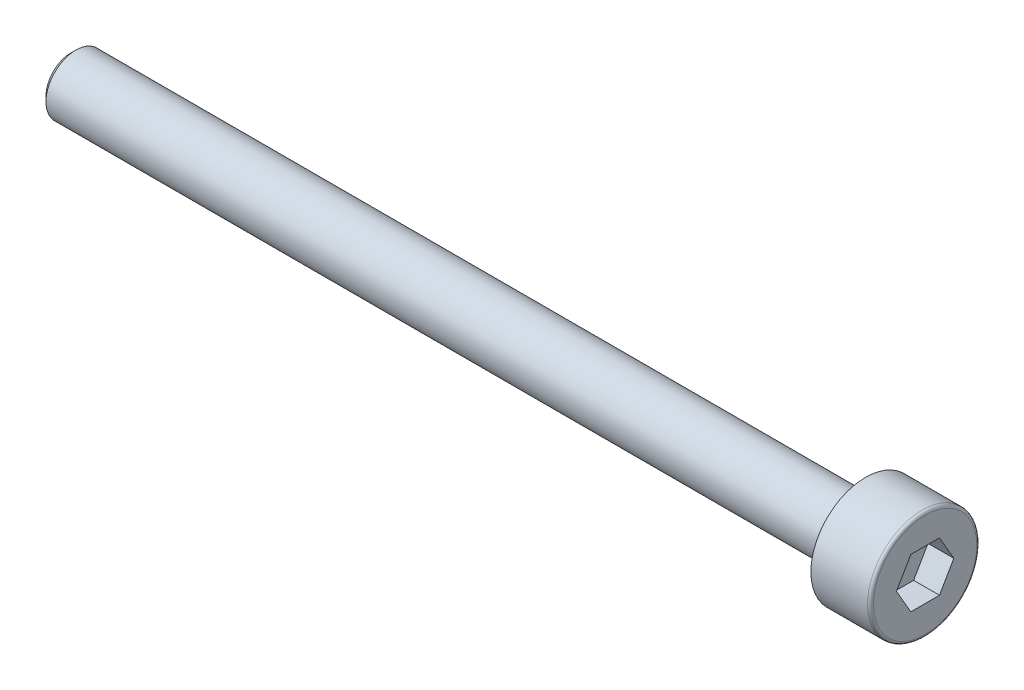
ISO-10303-21;
HEADER;
FILE_DESCRIPTION(('STEP AP214'),'2;1');
FILE_NAME('part.step','',(''),(''),'','','');
FILE_SCHEMA(('AUTOMOTIVE_DESIGN { 1 0 10303 214 1 1 1 1 }'));
ENDSEC;
DATA;
#1=APPLICATION_CONTEXT('core data for automotive mechanical design processes');
#2=APPLICATION_PROTOCOL_DEFINITION('international standard','automotive_design',2000,#1);
#3=PRODUCT_CONTEXT('',#1,'mechanical');
#4=PRODUCT('Part','Part','',(#3));
#5=PRODUCT_RELATED_PRODUCT_CATEGORY('part','',(#4));
#6=PRODUCT_DEFINITION_FORMATION('','',#4);
#7=PRODUCT_DEFINITION_CONTEXT('part definition',#1,'design');
#8=PRODUCT_DEFINITION('design','',#6,#7);
#9=PRODUCT_DEFINITION_SHAPE('','',#8);
#10=(LENGTH_UNIT() NAMED_UNIT(*) SI_UNIT(.MILLI.,.METRE.));
#11=(NAMED_UNIT(*) PLANE_ANGLE_UNIT() SI_UNIT($,.RADIAN.));
#12=(NAMED_UNIT(*) SI_UNIT($,.STERADIAN.) SOLID_ANGLE_UNIT());
#13=UNCERTAINTY_MEASURE_WITH_UNIT(LENGTH_MEASURE(1.E-05),#10,'distance_accuracy_value','');
#14=(GEOMETRIC_REPRESENTATION_CONTEXT(3) GLOBAL_UNCERTAINTY_ASSIGNED_CONTEXT((#13)) GLOBAL_UNIT_ASSIGNED_CONTEXT((#10,
#11,#12)) REPRESENTATION_CONTEXT('',''));
#15=CARTESIAN_POINT('',(0.,0.,0.));
#16=DIRECTION('',(0.,0.,1.));
#17=DIRECTION('',(1.,0.,0.));
#18=AXIS2_PLACEMENT_3D('',#15,#16,#17);
#19=CARTESIAN_POINT('',(0.,0.,0.));
#20=DIRECTION('',(1.,0.,0.));
#21=DIRECTION('',(0.,1.,0.));
#22=AXIS2_PLACEMENT_3D('',#19,#20,#21);
#23=PLANE('',#22);
#24=DIRECTION('',(0.,-0.866025403784439,0.5));
#25=VECTOR('',#24,1.);
#26=CARTESIAN_POINT('',(0.,1.25,0.721687836487035));
#27=LINE('',#26,#25);
#28=CARTESIAN_POINT('',(0.,1.25,0.721687836487035));
#29=VERTEX_POINT('',#28);
#30=CARTESIAN_POINT('',(0.,0.,1.44337567297407));
#31=VERTEX_POINT('',#30);
#32=EDGE_CURVE('E30',#29,#31,#27,.T.);
#33=ORIENTED_EDGE('',*,*,#32,.F.);
#34=DIRECTION('',(0.,0.,1.));
#35=VECTOR('',#34,1.);
#36=CARTESIAN_POINT('',(0.,1.25,-0.721687836487035));
#37=LINE('',#36,#35);
#38=CARTESIAN_POINT('',(0.,1.25,-0.721687836487035));
#39=VERTEX_POINT('',#38);
#40=EDGE_CURVE('E113',#39,#29,#37,.T.);
#41=ORIENTED_EDGE('',*,*,#40,.F.);
#42=DIRECTION('',(0.,0.866025403784439,0.5));
#43=VECTOR('',#42,1.);
#44=CARTESIAN_POINT('',(0.,0.,-1.44337567297406));
#45=LINE('',#44,#43);
#46=CARTESIAN_POINT('',(0.,0.,-1.44337567297406));
#47=VERTEX_POINT('',#46);
#48=EDGE_CURVE('E111',#47,#39,#45,.T.);
#49=ORIENTED_EDGE('',*,*,#48,.F.);
#50=DIRECTION('',(0.,0.866025403784439,-0.5));
#51=VECTOR('',#50,1.);
#52=CARTESIAN_POINT('',(0.,-1.25,-0.721687836487029));
#53=LINE('',#52,#51);
#54=CARTESIAN_POINT('',(0.,-1.25,-0.721687836487029));
#55=VERTEX_POINT('',#54);
#56=EDGE_CURVE('E78',#55,#47,#53,.T.);
#57=ORIENTED_EDGE('',*,*,#56,.F.);
#58=DIRECTION('',(0.,0.,-1.));
#59=VECTOR('',#58,1.);
#60=CARTESIAN_POINT('',(0.,-1.25,0.721687836487035));
#61=LINE('',#60,#59);
#62=CARTESIAN_POINT('',(0.,-1.25,0.721687836487035));
#63=VERTEX_POINT('',#62);
#64=EDGE_CURVE('E107',#63,#55,#61,.T.);
#65=ORIENTED_EDGE('',*,*,#64,.F.);
#66=DIRECTION('',(0.,-0.866025403784439,-0.5));
#67=VECTOR('',#66,1.);
#68=CARTESIAN_POINT('',(0.,0.,1.44337567297407));
#69=LINE('',#68,#67);
#70=EDGE_CURVE('E104',#31,#63,#69,.T.);
#71=ORIENTED_EDGE('',*,*,#70,.F.);
#72=EDGE_LOOP('',(#33,#41,#49,#57,#65,#71));
#73=FACE_BOUND('',#72,.T.);
#74=CARTESIAN_POINT('',(0.,0.,0.));
#75=DIRECTION('',(1.,0.,0.));
#76=DIRECTION('',(0.,1.,0.));
#77=AXIS2_PLACEMENT_3D('',#74,#75,#76);
#78=CIRCLE('',#77,2.6);
#79=CARTESIAN_POINT('',(0.,2.6,0.));
#80=VERTEX_POINT('',#79);
#81=EDGE_CURVE('E131',#80,#80,#78,.T.);
#82=ORIENTED_EDGE('',*,*,#81,.T.);
#83=EDGE_LOOP('',(#82));
#84=FACE_BOUND('',#83,.T.);
#85=ADVANCED_FACE('F15',(#73,#84),#23,.T.);
#86=CARTESIAN_POINT('',(-0.15,0.,0.));
#87=DIRECTION('',(1.,0.,0.));
#88=DIRECTION('',(0.,1.,0.));
#89=AXIS2_PLACEMENT_3D('',#86,#87,#88);
#90=TOROIDAL_SURFACE('',#89,2.6,0.15);
#91=CARTESIAN_POINT('',(-0.15,0.,0.));
#92=DIRECTION('',(1.,0.,0.));
#93=DIRECTION('',(0.,1.,0.));
#94=AXIS2_PLACEMENT_3D('',#91,#92,#93);
#95=CIRCLE('',#94,2.75);
#96=CARTESIAN_POINT('',(-0.15,2.75,0.));
#97=VERTEX_POINT('',#96);
#98=EDGE_CURVE('E128',#97,#97,#95,.T.);
#99=ORIENTED_EDGE('',*,*,#98,.T.);
#100=EDGE_LOOP('',(#99));
#101=FACE_BOUND('',#100,.T.);
#102=ORIENTED_EDGE('',*,*,#81,.F.);
#103=EDGE_LOOP('',(#102));
#104=FACE_BOUND('',#103,.T.);
#105=ADVANCED_FACE('F150',(#101,#104),#90,.T.);
#106=CARTESIAN_POINT('',(0.,0.,0.));
#107=DIRECTION('',(1.,0.,0.));
#108=DIRECTION('',(0.,1.,0.));
#109=AXIS2_PLACEMENT_3D('',#106,#107,#108);
#110=CYLINDRICAL_SURFACE('',#109,2.75);
#111=CARTESIAN_POINT('',(-3.,0.,0.));
#112=DIRECTION('',(1.,0.,0.));
#113=DIRECTION('',(0.,1.,0.));
#114=AXIS2_PLACEMENT_3D('',#111,#112,#113);
#115=CIRCLE('',#114,2.75);
#116=CARTESIAN_POINT('',(-3.,2.75,0.));
#117=VERTEX_POINT('',#116);
#118=EDGE_CURVE('E125',#117,#117,#115,.T.);
#119=ORIENTED_EDGE('',*,*,#118,.T.);
#120=EDGE_LOOP('',(#119));
#121=FACE_BOUND('',#120,.T.);
#122=ORIENTED_EDGE('',*,*,#98,.F.);
#123=EDGE_LOOP('',(#122));
#124=FACE_BOUND('',#123,.T.);
#125=ADVANCED_FACE('F156',(#121,#124),#110,.T.);
#126=CARTESIAN_POINT('',(-3.,2.75,0.));
#127=DIRECTION('',(-1.,0.,0.));
#128=DIRECTION('',(0.,-1.,0.));
#129=AXIS2_PLACEMENT_3D('',#126,#127,#128);
#130=PLANE('',#129);
#131=CARTESIAN_POINT('',(-3.,0.,0.));
#132=DIRECTION('',(1.,0.,0.));
#133=DIRECTION('',(0.,1.,0.));
#134=AXIS2_PLACEMENT_3D('',#131,#132,#133);
#135=CIRCLE('',#134,1.5);
#136=CARTESIAN_POINT('',(-3.,1.5,0.));
#137=VERTEX_POINT('',#136);
#138=EDGE_CURVE('E117',#137,#137,#135,.T.);
#139=ORIENTED_EDGE('',*,*,#138,.T.);
#140=EDGE_LOOP('',(#139));
#141=FACE_BOUND('',#140,.T.);
#142=ORIENTED_EDGE('',*,*,#118,.F.);
#143=EDGE_LOOP('',(#142));
#144=FACE_BOUND('',#143,.T.);
#145=ADVANCED_FACE('F163',(#141,#144),#130,.T.);
#146=CARTESIAN_POINT('',(0.,0.,0.));
#147=DIRECTION('',(1.,0.,0.));
#148=DIRECTION('',(0.,1.,0.));
#149=AXIS2_PLACEMENT_3D('',#146,#147,#148);
#150=CYLINDRICAL_SURFACE('',#149,1.5);
#151=CARTESIAN_POINT('',(-42.75,0.,0.));
#152=DIRECTION('',(-1.,0.,0.));
#153=DIRECTION('',(0.,-1.,0.));
#154=AXIS2_PLACEMENT_3D('',#151,#152,#153);
#155=CIRCLE('',#154,1.5);
#156=CARTESIAN_POINT('',(-42.75,-1.50000000000001,0.));
#157=VERTEX_POINT('',#156);
#158=EDGE_CURVE('E23',#157,#157,#155,.F.);
#159=ORIENTED_EDGE('',*,*,#158,.T.);
#160=EDGE_LOOP('',(#159));
#161=FACE_BOUND('',#160,.T.);
#162=ORIENTED_EDGE('',*,*,#138,.F.);
#163=EDGE_LOOP('',(#162));
#164=FACE_BOUND('',#163,.T.);
#165=ADVANCED_FACE('F136',(#161,#164),#150,.T.);
#166=CARTESIAN_POINT('',(-43.,1.5,0.));
#167=DIRECTION('',(-1.,0.,0.));
#168=DIRECTION('',(0.,-1.,0.));
#169=AXIS2_PLACEMENT_3D('',#166,#167,#168);
#170=PLANE('',#169);
#171=CARTESIAN_POINT('',(-43.,0.,0.));
#172=DIRECTION('',(-1.,0.,0.));
#173=DIRECTION('',(0.,-1.,0.));
#174=AXIS2_PLACEMENT_3D('',#171,#172,#173);
#175=CIRCLE('',#174,1.25000000000002);
#176=CARTESIAN_POINT('',(-43.,-1.25000000000003,0.));
#177=VERTEX_POINT('',#176);
#178=EDGE_CURVE('E9',#177,#177,#175,.T.);
#179=ORIENTED_EDGE('',*,*,#178,.T.);
#180=EDGE_LOOP('',(#179));
#181=FACE_BOUND('',#180,.T.);
#182=ADVANCED_FACE('F170',(#181),#170,.T.);
#183=CARTESIAN_POINT('',(-1.3,1.25,0.721687836487035));
#184=DIRECTION('',(0.,0.5,0.866025403784439));
#185=DIRECTION('',(0.,-0.866025403784439,0.5));
#186=AXIS2_PLACEMENT_3D('',#183,#184,#185);
#187=PLANE('',#186);
#188=ORIENTED_EDGE('',*,*,#32,.T.);
#189=DIRECTION('',(1.,0.,0.));
#190=VECTOR('',#189,1.);
#191=CARTESIAN_POINT('',(-1.3,0.,1.44337567297407));
#192=LINE('',#191,#190);
#193=CARTESIAN_POINT('',(-1.3,0.,1.44337567297407));
#194=VERTEX_POINT('',#193);
#195=EDGE_CURVE('E60',#194,#31,#192,.T.);
#196=ORIENTED_EDGE('',*,*,#195,.F.);
#197=DIRECTION('',(0.,-0.866025403784439,0.5));
#198=VECTOR('',#197,1.);
#199=CARTESIAN_POINT('',(-1.3,1.25,0.721687836487035));
#200=LINE('',#199,#198);
#201=CARTESIAN_POINT('',(-1.3,1.25,0.721687836487035));
#202=VERTEX_POINT('',#201);
#203=EDGE_CURVE('E115',#202,#194,#200,.T.);
#204=ORIENTED_EDGE('',*,*,#203,.F.);
#205=DIRECTION('',(1.,0.,0.));
#206=VECTOR('',#205,1.);
#207=CARTESIAN_POINT('',(-1.3,1.25,0.721687836487035));
#208=LINE('',#207,#206);
#209=EDGE_CURVE('E38',#202,#29,#208,.T.);
#210=ORIENTED_EDGE('',*,*,#209,.T.);
#211=EDGE_LOOP('',(#188,#196,#204,#210));
#212=FACE_BOUND('',#211,.T.);
#213=ADVANCED_FACE('F173',(#212),#187,.F.);
#214=CARTESIAN_POINT('',(-1.3,1.25,-0.721687836487035));
#215=DIRECTION('',(0.,1.,0.));
#216=DIRECTION('',(-1.,0.,0.));
#217=AXIS2_PLACEMENT_3D('',#214,#215,#216);
#218=PLANE('',#217);
#219=ORIENTED_EDGE('',*,*,#40,.T.);
#220=ORIENTED_EDGE('',*,*,#209,.F.);
#221=DIRECTION('',(0.,0.,1.));
#222=VECTOR('',#221,1.);
#223=CARTESIAN_POINT('',(-1.3,1.25,-0.721687836487035));
#224=LINE('',#223,#222);
#225=CARTESIAN_POINT('',(-1.3,1.25,-0.721687836487035));
#226=VERTEX_POINT('',#225);
#227=EDGE_CURVE('E90',#226,#202,#224,.T.);
#228=ORIENTED_EDGE('',*,*,#227,.F.);
#229=DIRECTION('',(1.,0.,0.));
#230=VECTOR('',#229,1.);
#231=CARTESIAN_POINT('',(-1.3,1.25,-0.721687836487035));
#232=LINE('',#231,#230);
#233=EDGE_CURVE('E82',#226,#39,#232,.T.);
#234=ORIENTED_EDGE('',*,*,#233,.T.);
#235=EDGE_LOOP('',(#219,#220,#228,#234));
#236=FACE_BOUND('',#235,.T.);
#237=ADVANCED_FACE('F177',(#236),#218,.F.);
#238=CARTESIAN_POINT('',(-1.3,0.,-1.44337567297406));
#239=DIRECTION('',(0.,0.5,-0.866025403784439));
#240=DIRECTION('',(0.,0.866025403784439,0.5));
#241=AXIS2_PLACEMENT_3D('',#238,#239,#240);
#242=PLANE('',#241);
#243=ORIENTED_EDGE('',*,*,#48,.T.);
#244=ORIENTED_EDGE('',*,*,#233,.F.);
#245=DIRECTION('',(0.,0.866025403784439,0.5));
#246=VECTOR('',#245,1.);
#247=CARTESIAN_POINT('',(-1.3,0.,-1.44337567297406));
#248=LINE('',#247,#246);
#249=CARTESIAN_POINT('',(-1.3,0.,-1.44337567297406));
#250=VERTEX_POINT('',#249);
#251=EDGE_CURVE('E86',#250,#226,#248,.T.);
#252=ORIENTED_EDGE('',*,*,#251,.F.);
#253=DIRECTION('',(1.,0.,0.));
#254=VECTOR('',#253,1.);
#255=CARTESIAN_POINT('',(-1.3,0.,-1.44337567297406));
#256=LINE('',#255,#254);
#257=EDGE_CURVE('E71',#250,#47,#256,.T.);
#258=ORIENTED_EDGE('',*,*,#257,.T.);
#259=EDGE_LOOP('',(#243,#244,#252,#258));
#260=FACE_BOUND('',#259,.T.);
#261=ADVANCED_FACE('F87',(#260),#242,.F.);
#262=CARTESIAN_POINT('',(-1.3,-1.25,-0.721687836487029));
#263=DIRECTION('',(0.,-0.5,-0.866025403784439));
#264=DIRECTION('',(0.,0.866025403784439,-0.5));
#265=AXIS2_PLACEMENT_3D('',#262,#263,#264);
#266=PLANE('',#265);
#267=ORIENTED_EDGE('',*,*,#56,.T.);
#268=ORIENTED_EDGE('',*,*,#257,.F.);
#269=DIRECTION('',(0.,0.866025403784439,-0.5));
#270=VECTOR('',#269,1.);
#271=CARTESIAN_POINT('',(-1.3,-1.25,-0.721687836487029));
#272=LINE('',#271,#270);
#273=CARTESIAN_POINT('',(-1.3,-1.25,-0.721687836487029));
#274=VERTEX_POINT('',#273);
#275=EDGE_CURVE('E75',#274,#250,#272,.T.);
#276=ORIENTED_EDGE('',*,*,#275,.F.);
#277=DIRECTION('',(1.,0.,0.));
#278=VECTOR('',#277,1.);
#279=CARTESIAN_POINT('',(-1.3,-1.25,-0.721687836487029));
#280=LINE('',#279,#278);
#281=EDGE_CURVE('E83',#274,#55,#280,.T.);
#282=ORIENTED_EDGE('',*,*,#281,.T.);
#283=EDGE_LOOP('',(#267,#268,#276,#282));
#284=FACE_BOUND('',#283,.T.);
#285=ADVANCED_FACE('F73',(#284),#266,.F.);
#286=CARTESIAN_POINT('',(-1.3,-1.25,0.721687836487035));
#287=DIRECTION('',(0.,-1.,0.));
#288=DIRECTION('',(0.,0.,-1.));
#289=AXIS2_PLACEMENT_3D('',#286,#287,#288);
#290=PLANE('',#289);
#291=ORIENTED_EDGE('',*,*,#64,.T.);
#292=ORIENTED_EDGE('',*,*,#281,.F.);
#293=DIRECTION('',(0.,0.,-1.));
#294=VECTOR('',#293,1.);
#295=CARTESIAN_POINT('',(-1.3,-1.25,0.721687836487035));
#296=LINE('',#295,#294);
#297=CARTESIAN_POINT('',(-1.3,-1.25,0.721687836487035));
#298=VERTEX_POINT('',#297);
#299=EDGE_CURVE('E96',#298,#274,#296,.T.);
#300=ORIENTED_EDGE('',*,*,#299,.F.);
#301=DIRECTION('',(1.,0.,0.));
#302=VECTOR('',#301,1.);
#303=CARTESIAN_POINT('',(-1.3,-1.25,0.721687836487035));
#304=LINE('',#303,#302);
#305=EDGE_CURVE('E120',#298,#63,#304,.T.);
#306=ORIENTED_EDGE('',*,*,#305,.T.);
#307=EDGE_LOOP('',(#291,#292,#300,#306));
#308=FACE_BOUND('',#307,.T.);
#309=ADVANCED_FACE('F180',(#308),#290,.F.);
#310=CARTESIAN_POINT('',(-1.3,0.,1.44337567297407));
#311=DIRECTION('',(0.,-0.5,0.866025403784439));
#312=DIRECTION('',(0.,-0.866025403784439,-0.5));
#313=AXIS2_PLACEMENT_3D('',#310,#311,#312);
#314=PLANE('',#313);
#315=ORIENTED_EDGE('',*,*,#70,.T.);
#316=ORIENTED_EDGE('',*,*,#305,.F.);
#317=DIRECTION('',(0.,-0.866025403784439,-0.5));
#318=VECTOR('',#317,1.);
#319=CARTESIAN_POINT('',(-1.3,0.,1.44337567297407));
#320=LINE('',#319,#318);
#321=EDGE_CURVE('E98',#194,#298,#320,.T.);
#322=ORIENTED_EDGE('',*,*,#321,.F.);
#323=ORIENTED_EDGE('',*,*,#195,.T.);
#324=EDGE_LOOP('',(#315,#316,#322,#323));
#325=FACE_BOUND('',#324,.T.);
#326=ADVANCED_FACE('F146',(#325),#314,.F.);
#327=CARTESIAN_POINT('',(-1.3,0.,1.44337567297407));
#328=DIRECTION('',(1.,0.,0.));
#329=DIRECTION('',(0.,1.,0.));
#330=AXIS2_PLACEMENT_3D('',#327,#328,#329);
#331=PLANE('',#330);
#332=ORIENTED_EDGE('',*,*,#203,.T.);
#333=ORIENTED_EDGE('',*,*,#321,.T.);
#334=ORIENTED_EDGE('',*,*,#299,.T.);
#335=ORIENTED_EDGE('',*,*,#275,.T.);
#336=ORIENTED_EDGE('',*,*,#251,.T.);
#337=ORIENTED_EDGE('',*,*,#227,.T.);
#338=EDGE_LOOP('',(#332,#333,#334,#335,#336,#337));
#339=FACE_BOUND('',#338,.T.);
#340=ADVANCED_FACE('F93',(#339),#331,.T.);
#341=CARTESIAN_POINT('',(-42.75,0.,0.));
#342=DIRECTION('',(1.,0.,0.));
#343=DIRECTION('',(0.,1.,0.));
#344=AXIS2_PLACEMENT_3D('',#341,#342,#343);
#345=CONICAL_SURFACE('',#344,1.5,0.785398163397452);
#346=ORIENTED_EDGE('',*,*,#178,.F.);
#347=EDGE_LOOP('',(#346));
#348=FACE_BOUND('',#347,.T.);
#349=ORIENTED_EDGE('',*,*,#158,.F.);
#350=EDGE_LOOP('',(#349));
#351=FACE_BOUND('',#350,.T.);
#352=ADVANCED_FACE('F17',(#348,#351),#345,.T.);
#353=CLOSED_SHELL('',(#85,#105,#125,#145,#165,#182,#213,#237,#261,#285,#309,#326,#340,#352));
#354=MANIFOLD_SOLID_BREP('B1',#353);
#355=ADVANCED_BREP_SHAPE_REPRESENTATION('',(#18,#354),#14);
#356=SHAPE_DEFINITION_REPRESENTATION(#9,#355);
ENDSEC;
END-ISO-10303-21;
